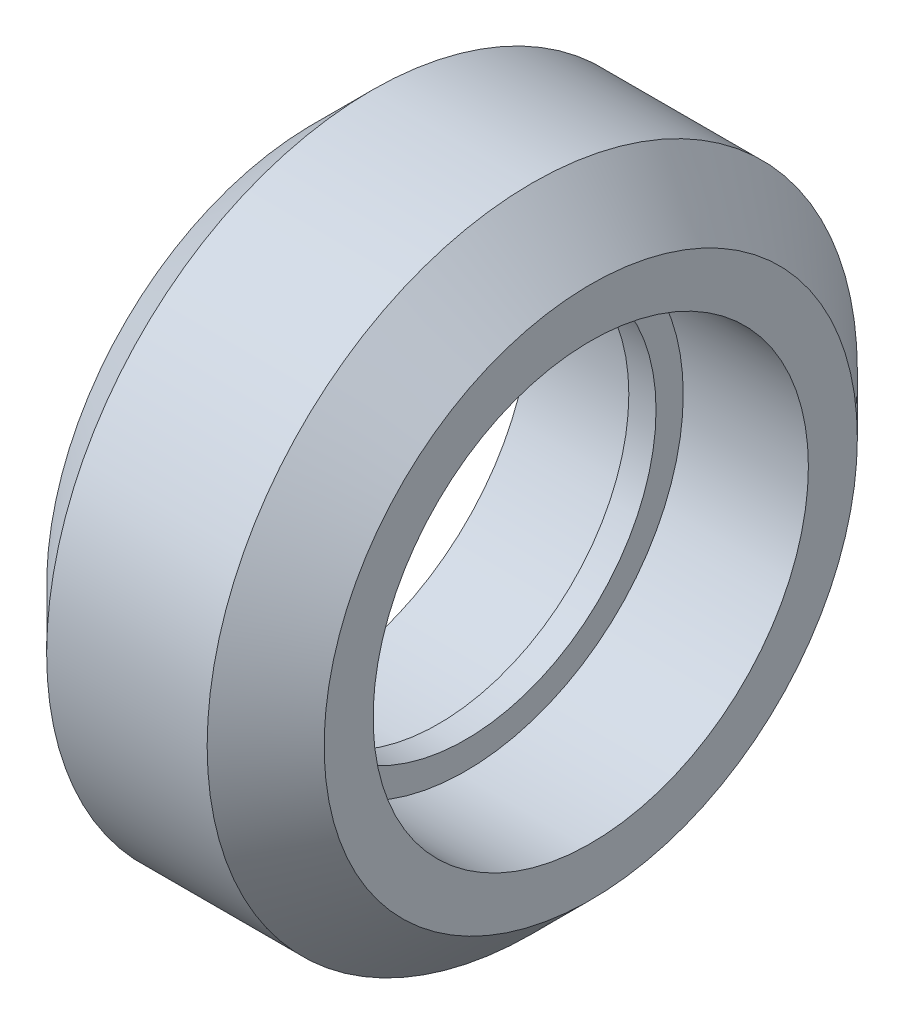
ISO-10303-21;
HEADER;
FILE_DESCRIPTION(('STEP AP214'),'2;1');
FILE_NAME('part.step','',(''),(''),'','','');
FILE_SCHEMA(('AUTOMOTIVE_DESIGN { 1 0 10303 214 1 1 1 1 }'));
ENDSEC;
DATA;
#1=APPLICATION_CONTEXT('core data for automotive mechanical design processes');
#2=APPLICATION_PROTOCOL_DEFINITION('international standard','automotive_design',2000,#1);
#3=PRODUCT_CONTEXT('',#1,'mechanical');
#4=PRODUCT('Part','Part','',(#3));
#5=PRODUCT_RELATED_PRODUCT_CATEGORY('part','',(#4));
#6=PRODUCT_DEFINITION_FORMATION('','',#4);
#7=PRODUCT_DEFINITION_CONTEXT('part definition',#1,'design');
#8=PRODUCT_DEFINITION('design','',#6,#7);
#9=PRODUCT_DEFINITION_SHAPE('','',#8);
#10=(LENGTH_UNIT() NAMED_UNIT(*) SI_UNIT(.MILLI.,.METRE.));
#11=(NAMED_UNIT(*) PLANE_ANGLE_UNIT() SI_UNIT($,.RADIAN.));
#12=(NAMED_UNIT(*) SI_UNIT($,.STERADIAN.) SOLID_ANGLE_UNIT());
#13=UNCERTAINTY_MEASURE_WITH_UNIT(LENGTH_MEASURE(1.E-05),#10,'distance_accuracy_value','');
#14=(GEOMETRIC_REPRESENTATION_CONTEXT(3) GLOBAL_UNCERTAINTY_ASSIGNED_CONTEXT((#13)) GLOBAL_UNIT_ASSIGNED_CONTEXT((#10,
#11,#12)) REPRESENTATION_CONTEXT('',''));
#15=CARTESIAN_POINT('',(0.,0.,0.));
#16=DIRECTION('',(0.,0.,1.));
#17=DIRECTION('',(1.,0.,0.));
#18=AXIS2_PLACEMENT_3D('',#15,#16,#17);
#19=CARTESIAN_POINT('',(-0.499999999999999,7.,0.));
#20=DIRECTION('',(-1.,0.,0.));
#21=DIRECTION('',(0.,0.,1.));
#22=AXIS2_PLACEMENT_3D('',#19,#20,#21);
#23=PLANE('',#22);
#24=CARTESIAN_POINT('',(-0.499999999999999,0.,0.));
#25=DIRECTION('',(1.,0.,0.));
#26=DIRECTION('',(0.,0.,-1.));
#27=AXIS2_PLACEMENT_3D('',#24,#25,#26);
#28=CIRCLE('',#27,7.);
#29=CARTESIAN_POINT('',(-0.499999999999999,0.,-7.));
#30=VERTEX_POINT('',#29);
#31=EDGE_CURVE('E10',#30,#30,#28,.T.);
#32=ORIENTED_EDGE('',*,*,#31,.T.);
#33=EDGE_LOOP('',(#32));
#34=FACE_BOUND('',#33,.T.);
#35=CARTESIAN_POINT('',(-0.499999999999999,0.,0.));
#36=DIRECTION('',(1.,0.,0.));
#37=DIRECTION('',(0.,0.,-1.));
#38=AXIS2_PLACEMENT_3D('',#35,#36,#37);
#39=CIRCLE('',#38,8.);
#40=CARTESIAN_POINT('',(-0.499999999999999,0.,-8.));
#41=VERTEX_POINT('',#40);
#42=EDGE_CURVE('E66',#41,#41,#39,.T.);
#43=ORIENTED_EDGE('',*,*,#42,.F.);
#44=EDGE_LOOP('',(#43));
#45=FACE_BOUND('',#44,.T.);
#46=ADVANCED_FACE('F32',(#34,#45),#23,.T.);
#47=CARTESIAN_POINT('',(0.,0.,0.));
#48=DIRECTION('',(1.,0.,0.));
#49=DIRECTION('',(0.,0.,-1.));
#50=AXIS2_PLACEMENT_3D('',#47,#48,#49);
#51=CYLINDRICAL_SURFACE('',#50,7.);
#52=CARTESIAN_POINT('',(0.500000000000001,0.,0.));
#53=DIRECTION('',(1.,0.,0.));
#54=DIRECTION('',(0.,0.,-1.));
#55=AXIS2_PLACEMENT_3D('',#52,#53,#54);
#56=CIRCLE('',#55,7.);
#57=CARTESIAN_POINT('',(0.500000000000001,0.,-7.));
#58=VERTEX_POINT('',#57);
#59=EDGE_CURVE('E38',#58,#58,#56,.T.);
#60=ORIENTED_EDGE('',*,*,#59,.T.);
#61=EDGE_LOOP('',(#60));
#62=FACE_BOUND('',#61,.T.);
#63=ORIENTED_EDGE('',*,*,#31,.F.);
#64=EDGE_LOOP('',(#63));
#65=FACE_BOUND('',#64,.T.);
#66=ADVANCED_FACE('F74',(#62,#65),#51,.F.);
#67=CARTESIAN_POINT('',(0.500000000000001,7.,0.));
#68=DIRECTION('',(1.,0.,0.));
#69=DIRECTION('',(0.,0.,-1.));
#70=AXIS2_PLACEMENT_3D('',#67,#68,#69);
#71=PLANE('',#70);
#72=CARTESIAN_POINT('',(0.5,0.,0.));
#73=DIRECTION('',(1.,0.,0.));
#74=DIRECTION('',(0.,0.,-1.));
#75=AXIS2_PLACEMENT_3D('',#72,#73,#74);
#76=CIRCLE('',#75,8.);
#77=CARTESIAN_POINT('',(0.5,0.,-8.));
#78=VERTEX_POINT('',#77);
#79=EDGE_CURVE('E42',#78,#78,#76,.T.);
#80=ORIENTED_EDGE('',*,*,#79,.T.);
#81=EDGE_LOOP('',(#80));
#82=FACE_BOUND('',#81,.T.);
#83=ORIENTED_EDGE('',*,*,#59,.F.);
#84=EDGE_LOOP('',(#83));
#85=FACE_BOUND('',#84,.T.);
#86=ADVANCED_FACE('F78',(#82,#85),#71,.T.);
#87=CARTESIAN_POINT('',(0.,0.,0.));
#88=DIRECTION('',(1.,0.,0.));
#89=DIRECTION('',(0.,0.,-1.));
#90=AXIS2_PLACEMENT_3D('',#87,#88,#89);
#91=CYLINDRICAL_SURFACE('',#90,8.);
#92=CARTESIAN_POINT('',(5.1,0.,0.));
#93=DIRECTION('',(1.,0.,0.));
#94=DIRECTION('',(0.,0.,-1.));
#95=AXIS2_PLACEMENT_3D('',#92,#93,#94);
#96=CIRCLE('',#95,8.);
#97=CARTESIAN_POINT('',(5.1,0.,-8.));
#98=VERTEX_POINT('',#97);
#99=EDGE_CURVE('E46',#98,#98,#96,.T.);
#100=ORIENTED_EDGE('',*,*,#99,.T.);
#101=EDGE_LOOP('',(#100));
#102=FACE_BOUND('',#101,.T.);
#103=ORIENTED_EDGE('',*,*,#79,.F.);
#104=EDGE_LOOP('',(#103));
#105=FACE_BOUND('',#104,.T.);
#106=ADVANCED_FACE('F82',(#102,#105),#91,.F.);
#107=CARTESIAN_POINT('',(5.1,8.,0.));
#108=DIRECTION('',(1.,0.,0.));
#109=DIRECTION('',(0.,0.,-1.));
#110=AXIS2_PLACEMENT_3D('',#107,#108,#109);
#111=PLANE('',#110);
#112=CARTESIAN_POINT('',(5.1,0.,0.));
#113=DIRECTION('',(1.,0.,0.));
#114=DIRECTION('',(0.,0.,-1.));
#115=AXIS2_PLACEMENT_3D('',#112,#113,#114);
#116=CIRCLE('',#115,9.80000000000001);
#117=CARTESIAN_POINT('',(5.1,0.,-9.80000000000001));
#118=VERTEX_POINT('',#117);
#119=EDGE_CURVE('E51',#118,#118,#116,.T.);
#120=ORIENTED_EDGE('',*,*,#119,.T.);
#121=EDGE_LOOP('',(#120));
#122=FACE_BOUND('',#121,.T.);
#123=ORIENTED_EDGE('',*,*,#99,.F.);
#124=EDGE_LOOP('',(#123));
#125=FACE_BOUND('',#124,.T.);
#126=ADVANCED_FACE('F89',(#122,#125),#111,.T.);
#127=CARTESIAN_POINT('',(5.1,0.,0.));
#128=DIRECTION('',(-1.,0.,0.));
#129=DIRECTION('',(0.,0.,1.));
#130=AXIS2_PLACEMENT_3D('',#127,#128,#129);
#131=CONICAL_SURFACE('',#130,9.80000000000001,0.785398163397446);
#132=CARTESIAN_POINT('',(2.95,0.,0.));
#133=DIRECTION('',(1.,0.,0.));
#134=DIRECTION('',(0.,0.,-1.));
#135=AXIS2_PLACEMENT_3D('',#132,#133,#134);
#136=CIRCLE('',#135,11.95);
#137=CARTESIAN_POINT('',(2.95,0.,-11.95));
#138=VERTEX_POINT('',#137);
#139=EDGE_CURVE('E54',#138,#138,#136,.T.);
#140=ORIENTED_EDGE('',*,*,#139,.T.);
#141=EDGE_LOOP('',(#140));
#142=FACE_BOUND('',#141,.T.);
#143=ORIENTED_EDGE('',*,*,#119,.F.);
#144=EDGE_LOOP('',(#143));
#145=FACE_BOUND('',#144,.T.);
#146=ADVANCED_FACE('F93',(#142,#145),#131,.T.);
#147=CARTESIAN_POINT('',(0.,0.,0.));
#148=DIRECTION('',(1.,0.,0.));
#149=DIRECTION('',(0.,0.,-1.));
#150=AXIS2_PLACEMENT_3D('',#147,#148,#149);
#151=CYLINDRICAL_SURFACE('',#150,11.95);
#152=CARTESIAN_POINT('',(-2.95,0.,0.));
#153=DIRECTION('',(1.,0.,0.));
#154=DIRECTION('',(0.,0.,-1.));
#155=AXIS2_PLACEMENT_3D('',#152,#153,#154);
#156=CIRCLE('',#155,11.95);
#157=CARTESIAN_POINT('',(-2.95,0.,-11.95));
#158=VERTEX_POINT('',#157);
#159=EDGE_CURVE('E57',#158,#158,#156,.T.);
#160=ORIENTED_EDGE('',*,*,#159,.T.);
#161=EDGE_LOOP('',(#160));
#162=FACE_BOUND('',#161,.T.);
#163=ORIENTED_EDGE('',*,*,#139,.F.);
#164=EDGE_LOOP('',(#163));
#165=FACE_BOUND('',#164,.T.);
#166=ADVANCED_FACE('F97',(#162,#165),#151,.T.);
#167=CARTESIAN_POINT('',(-2.95,0.,0.));
#168=DIRECTION('',(1.,0.,0.));
#169=DIRECTION('',(0.,0.,-1.));
#170=AXIS2_PLACEMENT_3D('',#167,#168,#169);
#171=CONICAL_SURFACE('',#170,11.95,0.785398163397447);
#172=CARTESIAN_POINT('',(-5.1,0.,0.));
#173=DIRECTION('',(1.,0.,0.));
#174=DIRECTION('',(0.,0.,-1.));
#175=AXIS2_PLACEMENT_3D('',#172,#173,#174);
#176=CIRCLE('',#175,9.80000000000001);
#177=CARTESIAN_POINT('',(-5.1,0.,-9.80000000000001));
#178=VERTEX_POINT('',#177);
#179=EDGE_CURVE('E60',#178,#178,#176,.T.);
#180=ORIENTED_EDGE('',*,*,#179,.T.);
#181=EDGE_LOOP('',(#180));
#182=FACE_BOUND('',#181,.T.);
#183=ORIENTED_EDGE('',*,*,#159,.F.);
#184=EDGE_LOOP('',(#183));
#185=FACE_BOUND('',#184,.T.);
#186=ADVANCED_FACE('F101',(#182,#185),#171,.T.);
#187=CARTESIAN_POINT('',(-5.1,8.,0.));
#188=DIRECTION('',(-1.,0.,0.));
#189=DIRECTION('',(0.,0.,1.));
#190=AXIS2_PLACEMENT_3D('',#187,#188,#189);
#191=PLANE('',#190);
#192=CARTESIAN_POINT('',(-5.1,0.,0.));
#193=DIRECTION('',(1.,0.,0.));
#194=DIRECTION('',(0.,0.,-1.));
#195=AXIS2_PLACEMENT_3D('',#192,#193,#194);
#196=CIRCLE('',#195,8.);
#197=CARTESIAN_POINT('',(-5.1,0.,-8.));
#198=VERTEX_POINT('',#197);
#199=EDGE_CURVE('E63',#198,#198,#196,.T.);
#200=ORIENTED_EDGE('',*,*,#199,.T.);
#201=EDGE_LOOP('',(#200));
#202=FACE_BOUND('',#201,.T.);
#203=ORIENTED_EDGE('',*,*,#179,.F.);
#204=EDGE_LOOP('',(#203));
#205=FACE_BOUND('',#204,.T.);
#206=ADVANCED_FACE('F105',(#202,#205),#191,.T.);
#207=CARTESIAN_POINT('',(0.,0.,0.));
#208=DIRECTION('',(1.,0.,0.));
#209=DIRECTION('',(0.,0.,-1.));
#210=AXIS2_PLACEMENT_3D('',#207,#208,#209);
#211=CYLINDRICAL_SURFACE('',#210,8.);
#212=ORIENTED_EDGE('',*,*,#42,.T.);
#213=EDGE_LOOP('',(#212));
#214=FACE_BOUND('',#213,.T.);
#215=ORIENTED_EDGE('',*,*,#199,.F.);
#216=EDGE_LOOP('',(#215));
#217=FACE_BOUND('',#216,.T.);
#218=ADVANCED_FACE('F70',(#214,#217),#211,.F.);
#219=CLOSED_SHELL('',(#46,#66,#86,#106,#126,#146,#166,#186,#206,#218));
#220=MANIFOLD_SOLID_BREP('B2',#219);
#221=ADVANCED_BREP_SHAPE_REPRESENTATION('',(#18,#220),#14);
#222=SHAPE_DEFINITION_REPRESENTATION(#9,#221);
ENDSEC;
END-ISO-10303-21;
